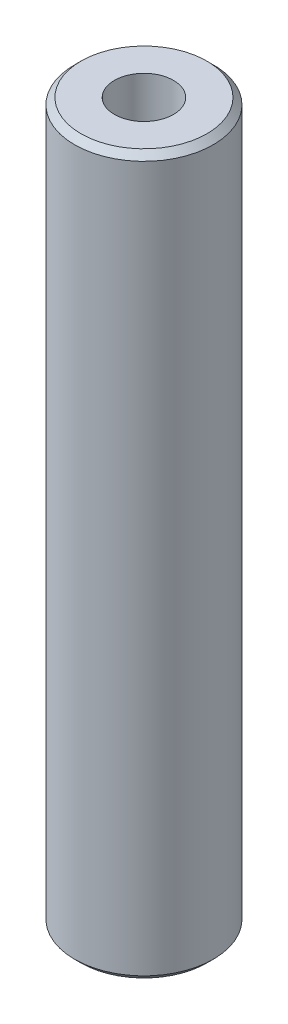
ISO-10303-21;
HEADER;
FILE_DESCRIPTION(('STEP AP214'),'2;1');
FILE_NAME('part.step','',(''),(''),'','','');
FILE_SCHEMA(('AUTOMOTIVE_DESIGN { 1 0 10303 214 1 1 1 1 }'));
ENDSEC;
DATA;
#1=APPLICATION_CONTEXT('core data for automotive mechanical design processes');
#2=APPLICATION_PROTOCOL_DEFINITION('international standard','automotive_design',2000,#1);
#3=PRODUCT_CONTEXT('',#1,'mechanical');
#4=PRODUCT('Part','Part','',(#3));
#5=PRODUCT_RELATED_PRODUCT_CATEGORY('part','',(#4));
#6=PRODUCT_DEFINITION_FORMATION('','',#4);
#7=PRODUCT_DEFINITION_CONTEXT('part definition',#1,'design');
#8=PRODUCT_DEFINITION('design','',#6,#7);
#9=PRODUCT_DEFINITION_SHAPE('','',#8);
#10=(LENGTH_UNIT() NAMED_UNIT(*) SI_UNIT(.MILLI.,.METRE.));
#11=(NAMED_UNIT(*) PLANE_ANGLE_UNIT() SI_UNIT($,.RADIAN.));
#12=(NAMED_UNIT(*) SI_UNIT($,.STERADIAN.) SOLID_ANGLE_UNIT());
#13=UNCERTAINTY_MEASURE_WITH_UNIT(LENGTH_MEASURE(1.E-05),#10,'distance_accuracy_value','');
#14=(GEOMETRIC_REPRESENTATION_CONTEXT(3) GLOBAL_UNCERTAINTY_ASSIGNED_CONTEXT((#13)) GLOBAL_UNIT_ASSIGNED_CONTEXT((#10,
#11,#12)) REPRESENTATION_CONTEXT('',''));
#15=CARTESIAN_POINT('',(0.,0.,0.));
#16=DIRECTION('',(0.,0.,1.));
#17=DIRECTION('',(1.,0.,0.));
#18=AXIS2_PLACEMENT_3D('',#15,#16,#17);
#19=CARTESIAN_POINT('',(0.,103.576799097126,0.));
#20=DIRECTION('',(0.,-1.,0.));
#21=DIRECTION('',(0.,0.,-1.));
#22=AXIS2_PLACEMENT_3D('',#19,#20,#21);
#23=CYLINDRICAL_SURFACE('',#22,10.);
#24=CARTESIAN_POINT('',(0.,102.659320125312,0.));
#25=DIRECTION('',(0.,1.,0.));
#26=DIRECTION('',(0.,0.,1.));
#27=AXIS2_PLACEMENT_3D('',#24,#25,#26);
#28=CIRCLE('',#27,10.);
#29=CARTESIAN_POINT('',(0.,102.659320125312,10.));
#30=VERTEX_POINT('',#29);
#31=EDGE_CURVE('E50',#30,#30,#28,.F.);
#32=ORIENTED_EDGE('',*,*,#31,.T.);
#33=EDGE_LOOP('',(#32));
#34=FACE_BOUND('',#33,.T.);
#35=CARTESIAN_POINT('',(0.,0.917478971813435,0.));
#36=DIRECTION('',(0.,1.,0.));
#37=DIRECTION('',(0.,0.,1.));
#38=AXIS2_PLACEMENT_3D('',#35,#36,#37);
#39=CIRCLE('',#38,10.);
#40=CARTESIAN_POINT('',(0.,0.917478971813435,10.));
#41=VERTEX_POINT('',#40);
#42=EDGE_CURVE('E51',#41,#41,#39,.T.);
#43=ORIENTED_EDGE('',*,*,#42,.T.);
#44=EDGE_LOOP('',(#43));
#45=FACE_BOUND('',#44,.T.);
#46=ADVANCED_FACE('F39',(#34,#45),#23,.T.);
#47=CARTESIAN_POINT('',(0.,103.576799097126,0.));
#48=DIRECTION('',(0.,1.,0.));
#49=DIRECTION('',(0.,0.,1.));
#50=AXIS2_PLACEMENT_3D('',#47,#48,#49);
#51=PLANE('',#50);
#52=CARTESIAN_POINT('',(0.,103.576799097126,0.));
#53=DIRECTION('',(0.,1.,0.));
#54=DIRECTION('',(0.,0.,1.));
#55=AXIS2_PLACEMENT_3D('',#52,#53,#54);
#56=CIRCLE('',#55,9.08252102818659);
#57=CARTESIAN_POINT('',(0.,103.576799097126,9.08252102818659));
#58=VERTEX_POINT('',#57);
#59=EDGE_CURVE('E54',#58,#58,#56,.T.);
#60=ORIENTED_EDGE('',*,*,#59,.T.);
#61=EDGE_LOOP('',(#60));
#62=FACE_BOUND('',#61,.T.);
#63=CARTESIAN_POINT('',(0.,103.576799097126,0.));
#64=DIRECTION('',(0.,1.,0.));
#65=DIRECTION('',(0.,0.,1.));
#66=AXIS2_PLACEMENT_3D('',#63,#64,#65);
#67=CIRCLE('',#66,4.2628759344708);
#68=CARTESIAN_POINT('',(0.,103.576799097126,4.2628759344708));
#69=VERTEX_POINT('',#68);
#70=EDGE_CURVE('E58',#69,#69,#67,.T.);
#71=ORIENTED_EDGE('',*,*,#70,.F.);
#72=EDGE_LOOP('',(#71));
#73=FACE_BOUND('',#72,.T.);
#74=ADVANCED_FACE('F69',(#62,#73),#51,.T.);
#75=CARTESIAN_POINT('',(0.,0.,0.));
#76=DIRECTION('',(0.,1.,0.));
#77=DIRECTION('',(0.,0.,1.));
#78=AXIS2_PLACEMENT_3D('',#75,#76,#77);
#79=PLANE('',#78);
#80=CARTESIAN_POINT('',(0.,0.,0.));
#81=DIRECTION('',(0.,1.,0.));
#82=DIRECTION('',(0.,0.,1.));
#83=AXIS2_PLACEMENT_3D('',#80,#81,#82);
#84=CIRCLE('',#83,9.08252102818656);
#85=CARTESIAN_POINT('',(0.,0.,9.08252102818656));
#86=VERTEX_POINT('',#85);
#87=EDGE_CURVE('E10',#86,#86,#84,.F.);
#88=ORIENTED_EDGE('',*,*,#87,.T.);
#89=EDGE_LOOP('',(#88));
#90=FACE_BOUND('',#89,.T.);
#91=CARTESIAN_POINT('',(0.,0.,0.));
#92=DIRECTION('',(0.,1.,0.));
#93=DIRECTION('',(0.,0.,1.));
#94=AXIS2_PLACEMENT_3D('',#91,#92,#93);
#95=CIRCLE('',#94,4.2628759344708);
#96=CARTESIAN_POINT('',(0.,0.,4.2628759344708));
#97=VERTEX_POINT('',#96);
#98=EDGE_CURVE('E63',#97,#97,#95,.T.);
#99=ORIENTED_EDGE('',*,*,#98,.T.);
#100=EDGE_LOOP('',(#99));
#101=FACE_BOUND('',#100,.T.);
#102=ADVANCED_FACE('F75',(#90,#101),#79,.F.);
#103=CARTESIAN_POINT('',(0.,103.576799097126,0.));
#104=DIRECTION('',(0.,-1.,0.));
#105=DIRECTION('',(0.,0.,-1.));
#106=AXIS2_PLACEMENT_3D('',#103,#104,#105);
#107=CYLINDRICAL_SURFACE('',#106,4.2628759344708);
#108=ORIENTED_EDGE('',*,*,#70,.T.);
#109=EDGE_LOOP('',(#108));
#110=FACE_BOUND('',#109,.T.);
#111=ORIENTED_EDGE('',*,*,#98,.F.);
#112=EDGE_LOOP('',(#111));
#113=FACE_BOUND('',#112,.T.);
#114=ADVANCED_FACE('F70',(#110,#113),#107,.F.);
#115=CARTESIAN_POINT('',(0.,103.576799097126,0.));
#116=DIRECTION('',(0.,-1.,0.));
#117=DIRECTION('',(0.,0.,-1.));
#118=AXIS2_PLACEMENT_3D('',#115,#116,#117);
#119=CONICAL_SURFACE('',#118,9.08252102818659,0.785398163397436);
#120=ORIENTED_EDGE('',*,*,#31,.F.);
#121=EDGE_LOOP('',(#120));
#122=FACE_BOUND('',#121,.T.);
#123=ORIENTED_EDGE('',*,*,#59,.F.);
#124=EDGE_LOOP('',(#123));
#125=FACE_BOUND('',#124,.T.);
#126=ADVANCED_FACE('F81',(#122,#125),#119,.T.);
#127=CARTESIAN_POINT('',(0.,0.917478971813435,0.));
#128=DIRECTION('',(0.,1.,0.));
#129=DIRECTION('',(0.,0.,1.));
#130=AXIS2_PLACEMENT_3D('',#127,#128,#129);
#131=CONICAL_SURFACE('',#130,10.,0.785398163397451);
#132=ORIENTED_EDGE('',*,*,#87,.F.);
#133=EDGE_LOOP('',(#132));
#134=FACE_BOUND('',#133,.T.);
#135=ORIENTED_EDGE('',*,*,#42,.F.);
#136=EDGE_LOOP('',(#135));
#137=FACE_BOUND('',#136,.T.);
#138=ADVANCED_FACE('F45',(#134,#137),#131,.T.);
#139=CLOSED_SHELL('',(#46,#74,#102,#114,#126,#138));
#140=MANIFOLD_SOLID_BREP('B2',#139);
#141=ADVANCED_BREP_SHAPE_REPRESENTATION('',(#18,#140),#14);
#142=SHAPE_DEFINITION_REPRESENTATION(#9,#141);
ENDSEC;
END-ISO-10303-21;
